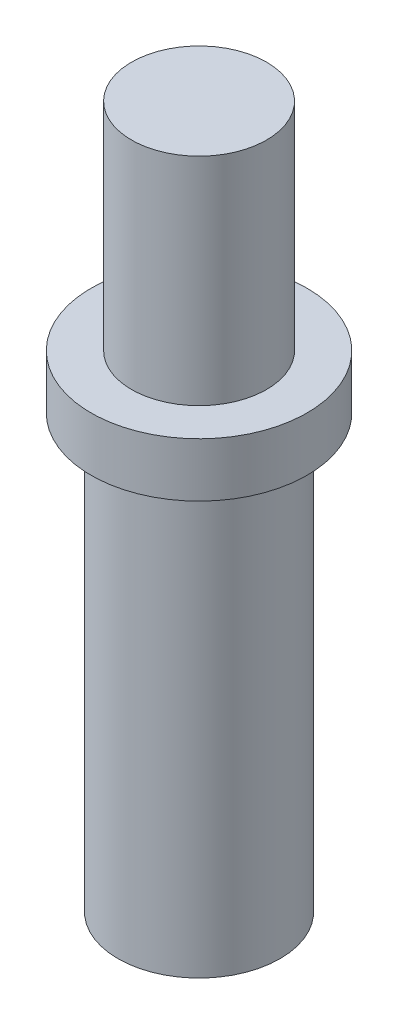
ISO-10303-21;
HEADER;
FILE_DESCRIPTION(('STEP AP214'),'2;1');
FILE_NAME('part.step','',(''),(''),'','','');
FILE_SCHEMA(('AUTOMOTIVE_DESIGN { 1 0 10303 214 1 1 1 1 }'));
ENDSEC;
DATA;
#1=APPLICATION_CONTEXT('core data for automotive mechanical design processes');
#2=APPLICATION_PROTOCOL_DEFINITION('international standard','automotive_design',2000,#1);
#3=PRODUCT_CONTEXT('',#1,'mechanical');
#4=PRODUCT('Part','Part','',(#3));
#5=PRODUCT_RELATED_PRODUCT_CATEGORY('part','',(#4));
#6=PRODUCT_DEFINITION_FORMATION('','',#4);
#7=PRODUCT_DEFINITION_CONTEXT('part definition',#1,'design');
#8=PRODUCT_DEFINITION('design','',#6,#7);
#9=PRODUCT_DEFINITION_SHAPE('','',#8);
#10=(LENGTH_UNIT() NAMED_UNIT(*) SI_UNIT(.MILLI.,.METRE.));
#11=(NAMED_UNIT(*) PLANE_ANGLE_UNIT() SI_UNIT($,.RADIAN.));
#12=(NAMED_UNIT(*) SI_UNIT($,.STERADIAN.) SOLID_ANGLE_UNIT());
#13=UNCERTAINTY_MEASURE_WITH_UNIT(LENGTH_MEASURE(1.E-05),#10,'distance_accuracy_value','');
#14=(GEOMETRIC_REPRESENTATION_CONTEXT(3) GLOBAL_UNCERTAINTY_ASSIGNED_CONTEXT((#13)) GLOBAL_UNIT_ASSIGNED_CONTEXT((#10,
#11,#12)) REPRESENTATION_CONTEXT('',''));
#15=CARTESIAN_POINT('',(0.,0.,0.));
#16=DIRECTION('',(0.,0.,1.));
#17=DIRECTION('',(1.,0.,0.));
#18=AXIS2_PLACEMENT_3D('',#15,#16,#17);
#19=CARTESIAN_POINT('',(3.,27.2296979865772,0.));
#20=DIRECTION('',(0.,-1.,0.));
#21=DIRECTION('',(0.,0.,-1.));
#22=AXIS2_PLACEMENT_3D('',#19,#20,#21);
#23=PLANE('',#22);
#24=CARTESIAN_POINT('',(0.,27.2296979865772,0.));
#25=DIRECTION('',(0.,-1.,0.));
#26=DIRECTION('',(0.,0.,-1.));
#27=AXIS2_PLACEMENT_3D('',#24,#25,#26);
#28=CIRCLE('',#27,4.);
#29=CARTESIAN_POINT('',(0.,27.2296979865772,-4.));
#30=VERTEX_POINT('',#29);
#31=EDGE_CURVE('E10',#30,#30,#28,.T.);
#32=ORIENTED_EDGE('',*,*,#31,.T.);
#33=EDGE_LOOP('',(#32));
#34=FACE_BOUND('',#33,.T.);
#35=CARTESIAN_POINT('',(0.,27.2296979865772,0.));
#36=DIRECTION('',(0.,-1.,0.));
#37=DIRECTION('',(0.,0.,-1.));
#38=AXIS2_PLACEMENT_3D('',#35,#36,#37);
#39=CIRCLE('',#38,3.);
#40=CARTESIAN_POINT('',(0.,27.2296979865772,-3.));
#41=VERTEX_POINT('',#40);
#42=EDGE_CURVE('E57',#41,#41,#39,.T.);
#43=ORIENTED_EDGE('',*,*,#42,.F.);
#44=EDGE_LOOP('',(#43));
#45=FACE_BOUND('',#44,.T.);
#46=ADVANCED_FACE('F29',(#34,#45),#23,.T.);
#47=CARTESIAN_POINT('',(0.,0.,0.));
#48=DIRECTION('',(0.,-1.,0.));
#49=DIRECTION('',(0.,0.,-1.));
#50=AXIS2_PLACEMENT_3D('',#47,#48,#49);
#51=CYLINDRICAL_SURFACE('',#50,4.);
#52=CARTESIAN_POINT('',(0.,29.2296979865772,0.));
#53=DIRECTION('',(0.,-1.,0.));
#54=DIRECTION('',(0.,0.,-1.));
#55=AXIS2_PLACEMENT_3D('',#52,#53,#54);
#56=CIRCLE('',#55,4.);
#57=CARTESIAN_POINT('',(0.,29.2296979865772,-4.));
#58=VERTEX_POINT('',#57);
#59=EDGE_CURVE('E35',#58,#58,#56,.T.);
#60=ORIENTED_EDGE('',*,*,#59,.T.);
#61=EDGE_LOOP('',(#60));
#62=FACE_BOUND('',#61,.T.);
#63=ORIENTED_EDGE('',*,*,#31,.F.);
#64=EDGE_LOOP('',(#63));
#65=FACE_BOUND('',#64,.T.);
#66=ADVANCED_FACE('F65',(#62,#65),#51,.T.);
#67=CARTESIAN_POINT('',(2.5,29.2296979865772,0.));
#68=DIRECTION('',(0.,1.,0.));
#69=DIRECTION('',(0.,0.,1.));
#70=AXIS2_PLACEMENT_3D('',#67,#68,#69);
#71=PLANE('',#70);
#72=CARTESIAN_POINT('',(0.,29.2296979865772,0.));
#73=DIRECTION('',(0.,-1.,0.));
#74=DIRECTION('',(0.,0.,-1.));
#75=AXIS2_PLACEMENT_3D('',#72,#73,#74);
#76=CIRCLE('',#75,2.5);
#77=CARTESIAN_POINT('',(0.,29.2296979865772,-2.5));
#78=VERTEX_POINT('',#77);
#79=EDGE_CURVE('E39',#78,#78,#76,.T.);
#80=ORIENTED_EDGE('',*,*,#79,.T.);
#81=EDGE_LOOP('',(#80));
#82=FACE_BOUND('',#81,.T.);
#83=ORIENTED_EDGE('',*,*,#59,.F.);
#84=EDGE_LOOP('',(#83));
#85=FACE_BOUND('',#84,.T.);
#86=ADVANCED_FACE('F69',(#82,#85),#71,.T.);
#87=CARTESIAN_POINT('',(0.,0.,0.));
#88=DIRECTION('',(0.,-1.,0.));
#89=DIRECTION('',(0.,0.,-1.));
#90=AXIS2_PLACEMENT_3D('',#87,#88,#89);
#91=CYLINDRICAL_SURFACE('',#90,2.5);
#92=CARTESIAN_POINT('',(0.,37.2296979865772,0.));
#93=DIRECTION('',(0.,-1.,0.));
#94=DIRECTION('',(0.,0.,-1.));
#95=AXIS2_PLACEMENT_3D('',#92,#93,#94);
#96=CIRCLE('',#95,2.5);
#97=CARTESIAN_POINT('',(0.,37.2296979865772,-2.5));
#98=VERTEX_POINT('',#97);
#99=EDGE_CURVE('E43',#98,#98,#96,.T.);
#100=ORIENTED_EDGE('',*,*,#99,.T.);
#101=EDGE_LOOP('',(#100));
#102=FACE_BOUND('',#101,.T.);
#103=ORIENTED_EDGE('',*,*,#79,.F.);
#104=EDGE_LOOP('',(#103));
#105=FACE_BOUND('',#104,.T.);
#106=ADVANCED_FACE('F73',(#102,#105),#91,.T.);
#107=CARTESIAN_POINT('',(0.,37.2296979865772,0.));
#108=DIRECTION('',(0.,1.,0.));
#109=DIRECTION('',(0.,0.,1.));
#110=AXIS2_PLACEMENT_3D('',#107,#108,#109);
#111=PLANE('',#110);
#112=ORIENTED_EDGE('',*,*,#99,.F.);
#113=EDGE_LOOP('',(#112));
#114=FACE_BOUND('',#113,.T.);
#115=ADVANCED_FACE('F80',(#114),#111,.T.);
#116=CARTESIAN_POINT('',(0.,26.2296979865772,0.));
#117=DIRECTION('',(0.,-1.,0.));
#118=DIRECTION('',(0.,0.,-1.));
#119=AXIS2_PLACEMENT_3D('',#116,#117,#118);
#120=PLANE('',#119);
#121=CARTESIAN_POINT('',(0.,26.2296979865772,0.));
#122=DIRECTION('',(0.,-1.,0.));
#123=DIRECTION('',(0.,0.,-1.));
#124=AXIS2_PLACEMENT_3D('',#121,#122,#123);
#125=CIRCLE('',#124,2.);
#126=CARTESIAN_POINT('',(0.,26.2296979865772,-2.));
#127=VERTEX_POINT('',#126);
#128=EDGE_CURVE('E48',#127,#127,#125,.T.);
#129=ORIENTED_EDGE('',*,*,#128,.T.);
#130=EDGE_LOOP('',(#129));
#131=FACE_BOUND('',#130,.T.);
#132=ADVANCED_FACE('F84',(#131),#120,.T.);
#133=CARTESIAN_POINT('',(0.,0.,0.));
#134=DIRECTION('',(0.,-1.,0.));
#135=DIRECTION('',(0.,0.,-1.));
#136=AXIS2_PLACEMENT_3D('',#133,#134,#135);
#137=CYLINDRICAL_SURFACE('',#136,2.);
#138=CARTESIAN_POINT('',(0.,11.2296979865772,0.));
#139=DIRECTION('',(0.,-1.,0.));
#140=DIRECTION('',(0.,0.,-1.));
#141=AXIS2_PLACEMENT_3D('',#138,#139,#140);
#142=CIRCLE('',#141,2.);
#143=CARTESIAN_POINT('',(0.,11.2296979865772,-2.));
#144=VERTEX_POINT('',#143);
#145=EDGE_CURVE('E51',#144,#144,#142,.T.);
#146=ORIENTED_EDGE('',*,*,#145,.T.);
#147=EDGE_LOOP('',(#146));
#148=FACE_BOUND('',#147,.T.);
#149=ORIENTED_EDGE('',*,*,#128,.F.);
#150=EDGE_LOOP('',(#149));
#151=FACE_BOUND('',#150,.T.);
#152=ADVANCED_FACE('F88',(#148,#151),#137,.F.);
#153=CARTESIAN_POINT('',(2.,11.2296979865772,0.));
#154=DIRECTION('',(0.,-1.,0.));
#155=DIRECTION('',(0.,0.,-1.));
#156=AXIS2_PLACEMENT_3D('',#153,#154,#155);
#157=PLANE('',#156);
#158=CARTESIAN_POINT('',(0.,11.2296979865772,0.));
#159=DIRECTION('',(0.,-1.,0.));
#160=DIRECTION('',(0.,0.,-1.));
#161=AXIS2_PLACEMENT_3D('',#158,#159,#160);
#162=CIRCLE('',#161,3.);
#163=CARTESIAN_POINT('',(0.,11.2296979865772,-3.));
#164=VERTEX_POINT('',#163);
#165=EDGE_CURVE('E54',#164,#164,#162,.T.);
#166=ORIENTED_EDGE('',*,*,#165,.T.);
#167=EDGE_LOOP('',(#166));
#168=FACE_BOUND('',#167,.T.);
#169=ORIENTED_EDGE('',*,*,#145,.F.);
#170=EDGE_LOOP('',(#169));
#171=FACE_BOUND('',#170,.T.);
#172=ADVANCED_FACE('F92',(#168,#171),#157,.T.);
#173=CARTESIAN_POINT('',(0.,0.,0.));
#174=DIRECTION('',(0.,-1.,0.));
#175=DIRECTION('',(0.,0.,-1.));
#176=AXIS2_PLACEMENT_3D('',#173,#174,#175);
#177=CYLINDRICAL_SURFACE('',#176,3.);
#178=ORIENTED_EDGE('',*,*,#42,.T.);
#179=EDGE_LOOP('',(#178));
#180=FACE_BOUND('',#179,.T.);
#181=ORIENTED_EDGE('',*,*,#165,.F.);
#182=EDGE_LOOP('',(#181));
#183=FACE_BOUND('',#182,.T.);
#184=ADVANCED_FACE('F61',(#180,#183),#177,.T.);
#185=CLOSED_SHELL('',(#46,#66,#86,#106,#115,#132,#152,#172,#184));
#186=MANIFOLD_SOLID_BREP('B2',#185);
#187=ADVANCED_BREP_SHAPE_REPRESENTATION('',(#18,#186),#14);
#188=SHAPE_DEFINITION_REPRESENTATION(#9,#187);
ENDSEC;
END-ISO-10303-21;
